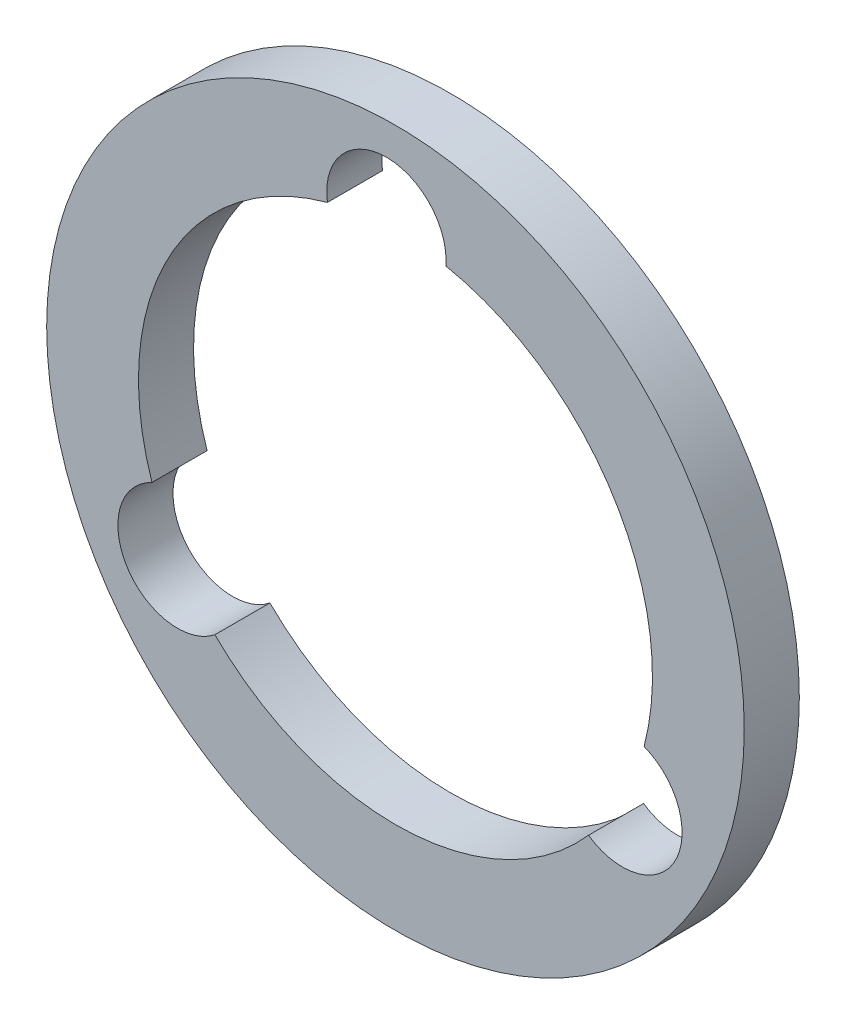
ISO-10303-21;
HEADER;
FILE_DESCRIPTION(('STEP AP214'),'2;1');
FILE_NAME('part.step','',(''),(''),'','','');
FILE_SCHEMA(('AUTOMOTIVE_DESIGN { 1 0 10303 214 1 1 1 1 }'));
ENDSEC;
DATA;
#1=APPLICATION_CONTEXT('core data for automotive mechanical design processes');
#2=APPLICATION_PROTOCOL_DEFINITION('international standard','automotive_design',2000,#1);
#3=PRODUCT_CONTEXT('',#1,'mechanical');
#4=PRODUCT('Part','Part','',(#3));
#5=PRODUCT_RELATED_PRODUCT_CATEGORY('part','',(#4));
#6=PRODUCT_DEFINITION_FORMATION('','',#4);
#7=PRODUCT_DEFINITION_CONTEXT('part definition',#1,'design');
#8=PRODUCT_DEFINITION('design','',#6,#7);
#9=PRODUCT_DEFINITION_SHAPE('','',#8);
#10=(LENGTH_UNIT() NAMED_UNIT(*) SI_UNIT(.MILLI.,.METRE.));
#11=(NAMED_UNIT(*) PLANE_ANGLE_UNIT() SI_UNIT($,.RADIAN.));
#12=(NAMED_UNIT(*) SI_UNIT($,.STERADIAN.) SOLID_ANGLE_UNIT());
#13=UNCERTAINTY_MEASURE_WITH_UNIT(LENGTH_MEASURE(1.E-05),#10,'distance_accuracy_value','');
#14=(GEOMETRIC_REPRESENTATION_CONTEXT(3) GLOBAL_UNCERTAINTY_ASSIGNED_CONTEXT((#13)) GLOBAL_UNIT_ASSIGNED_CONTEXT((#10,
#11,#12)) REPRESENTATION_CONTEXT('',''));
#15=CARTESIAN_POINT('',(0.,0.,0.));
#16=DIRECTION('',(0.,0.,1.));
#17=DIRECTION('',(1.,0.,0.));
#18=AXIS2_PLACEMENT_3D('',#15,#16,#17);
#19=CARTESIAN_POINT('',(0.,0.,3.));
#20=DIRECTION('',(0.,0.,1.));
#21=DIRECTION('',(1.,0.,0.));
#22=AXIS2_PLACEMENT_3D('',#19,#20,#21);
#23=PLANE('',#22);
#24=CARTESIAN_POINT('',(0.,0.,3.));
#25=DIRECTION('',(0.,0.,1.));
#26=DIRECTION('',(1.,0.,0.));
#27=AXIS2_PLACEMENT_3D('',#24,#25,#26);
#28=CIRCLE('',#27,19.);
#29=CARTESIAN_POINT('',(19.,0.,3.));
#30=VERTEX_POINT('',#29);
#31=EDGE_CURVE('E11',#30,#30,#28,.T.);
#32=ORIENTED_EDGE('',*,*,#31,.T.);
#33=EDGE_LOOP('',(#32));
#34=FACE_BOUND('',#33,.T.);
#35=CARTESIAN_POINT('',(-0.493805045382954,13.9912885960213,3.));
#36=DIRECTION('',(0.,0.,1.));
#37=DIRECTION('',(1.,0.,0.));
#38=AXIS2_PLACEMENT_3D('',#35,#36,#37);
#39=CIRCLE('',#38,3.25);
#40=CARTESIAN_POINT('',(2.745524809487,13.7281496757754,3.));
#41=VERTEX_POINT('',#40);
#42=CARTESIAN_POINT('',(-3.70652359519242,13.50043269078,3.));
#43=VERTEX_POINT('',#42);
#44=EDGE_CURVE('E94',#41,#43,#39,.T.);
#45=ORIENTED_EDGE('',*,*,#44,.F.);
#46=CARTESIAN_POINT('',(0.,0.,3.));
#47=DIRECTION('',(0.,0.,1.));
#48=DIRECTION('',(1.,0.,0.));
#49=AXIS2_PLACEMENT_3D('',#46,#47,#48);
#50=CIRCLE('',#49,14.);
#51=CARTESIAN_POINT('',(13.5449794698936,-3.54027275222695,3.));
#52=VERTEX_POINT('',#51);
#53=EDGE_CURVE('E86',#52,#41,#50,.T.);
#54=ORIENTED_EDGE('',*,*,#53,.F.);
#55=CARTESIAN_POINT('',(12.3637138785254,-6.56799658419206,3.));
#56=DIRECTION('',(0.,0.,1.));
#57=DIRECTION('',(1.,0.,0.));
#58=AXIS2_PLACEMENT_3D('',#55,#56,#57);
#59=CIRCLE('',#58,3.25);
#60=CARTESIAN_POINT('',(10.5161639614331,-9.24176906962385,3.));
#61=VERTEX_POINT('',#60);
#62=EDGE_CURVE('E114',#61,#52,#59,.T.);
#63=ORIENTED_EDGE('',*,*,#62,.F.);
#64=CARTESIAN_POINT('',(0.,0.,3.));
#65=DIRECTION('',(0.,0.,1.));
#66=DIRECTION('',(1.,0.,0.));
#67=AXIS2_PLACEMENT_3D('',#64,#65,#66);
#68=CIRCLE('',#67,14.);
#69=CARTESIAN_POINT('',(-9.83845587470119,-9.96015993855307,3.));
#70=VERTEX_POINT('',#69);
#71=EDGE_CURVE('E112',#70,#61,#68,.T.);
#72=ORIENTED_EDGE('',*,*,#71,.F.);
#73=CARTESIAN_POINT('',(-11.8699088331424,-7.4232920118292,3.));
#74=DIRECTION('',(0.,0.,1.));
#75=DIRECTION('',(1.,0.,0.));
#76=AXIS2_PLACEMENT_3D('',#73,#74,#75);
#77=CIRCLE('',#76,3.25);
#78=CARTESIAN_POINT('',(-13.2616887709201,-4.48638060615151,3.));
#79=VERTEX_POINT('',#78);
#80=EDGE_CURVE('E108',#79,#70,#77,.T.);
#81=ORIENTED_EDGE('',*,*,#80,.F.);
#82=CARTESIAN_POINT('',(0.,0.,3.));
#83=DIRECTION('',(0.,0.,1.));
#84=DIRECTION('',(1.,0.,0.));
#85=AXIS2_PLACEMENT_3D('',#82,#83,#84);
#86=CIRCLE('',#85,14.);
#87=EDGE_CURVE('E106',#43,#79,#86,.T.);
#88=ORIENTED_EDGE('',*,*,#87,.F.);
#89=EDGE_LOOP('',(#45,#54,#63,#72,#81,#88));
#90=FACE_BOUND('',#89,.T.);
#91=ADVANCED_FACE('F33',(#34,#90),#23,.T.);
#92=CARTESIAN_POINT('',(0.,0.,0.));
#93=DIRECTION('',(0.,0.,1.));
#94=DIRECTION('',(1.,0.,0.));
#95=AXIS2_PLACEMENT_3D('',#92,#93,#94);
#96=PLANE('',#95);
#97=CARTESIAN_POINT('',(0.,0.,0.));
#98=DIRECTION('',(0.,0.,1.));
#99=DIRECTION('',(1.,0.,0.));
#100=AXIS2_PLACEMENT_3D('',#97,#98,#99);
#101=CIRCLE('',#100,19.);
#102=CARTESIAN_POINT('',(19.,0.,0.));
#103=VERTEX_POINT('',#102);
#104=EDGE_CURVE('E37',#103,#103,#101,.T.);
#105=ORIENTED_EDGE('',*,*,#104,.F.);
#106=EDGE_LOOP('',(#105));
#107=FACE_BOUND('',#106,.T.);
#108=CARTESIAN_POINT('',(0.,0.,0.));
#109=DIRECTION('',(0.,0.,1.));
#110=DIRECTION('',(1.,0.,0.));
#111=AXIS2_PLACEMENT_3D('',#108,#109,#110);
#112=CIRCLE('',#111,14.);
#113=CARTESIAN_POINT('',(13.5449794698936,-3.54027275222694,0.));
#114=VERTEX_POINT('',#113);
#115=CARTESIAN_POINT('',(2.745524809487,13.7281496757754,0.));
#116=VERTEX_POINT('',#115);
#117=EDGE_CURVE('E56',#114,#116,#112,.T.);
#118=ORIENTED_EDGE('',*,*,#117,.T.);
#119=CARTESIAN_POINT('',(-0.493805045382954,13.9912885960213,0.));
#120=DIRECTION('',(0.,0.,1.));
#121=DIRECTION('',(1.,0.,0.));
#122=AXIS2_PLACEMENT_3D('',#119,#120,#121);
#123=CIRCLE('',#122,3.25);
#124=CARTESIAN_POINT('',(-3.70652359519242,13.50043269078,0.));
#125=VERTEX_POINT('',#124);
#126=EDGE_CURVE('E101',#116,#125,#123,.T.);
#127=ORIENTED_EDGE('',*,*,#126,.T.);
#128=CARTESIAN_POINT('',(0.,0.,0.));
#129=DIRECTION('',(0.,0.,1.));
#130=DIRECTION('',(1.,0.,0.));
#131=AXIS2_PLACEMENT_3D('',#128,#129,#130);
#132=CIRCLE('',#131,14.);
#133=CARTESIAN_POINT('',(-13.2616887709201,-4.48638060615151,0.));
#134=VERTEX_POINT('',#133);
#135=EDGE_CURVE('E118',#125,#134,#132,.T.);
#136=ORIENTED_EDGE('',*,*,#135,.T.);
#137=CARTESIAN_POINT('',(-11.8699088331424,-7.4232920118292,0.));
#138=DIRECTION('',(0.,0.,1.));
#139=DIRECTION('',(1.,0.,0.));
#140=AXIS2_PLACEMENT_3D('',#137,#138,#139);
#141=CIRCLE('',#140,3.25);
#142=CARTESIAN_POINT('',(-9.83845587470119,-9.96015993855307,0.));
#143=VERTEX_POINT('',#142);
#144=EDGE_CURVE('E121',#134,#143,#141,.T.);
#145=ORIENTED_EDGE('',*,*,#144,.T.);
#146=CARTESIAN_POINT('',(0.,0.,0.));
#147=DIRECTION('',(0.,0.,1.));
#148=DIRECTION('',(1.,0.,0.));
#149=AXIS2_PLACEMENT_3D('',#146,#147,#148);
#150=CIRCLE('',#149,14.);
#151=CARTESIAN_POINT('',(10.5161639614331,-9.24176906962386,0.));
#152=VERTEX_POINT('',#151);
#153=EDGE_CURVE('E124',#143,#152,#150,.T.);
#154=ORIENTED_EDGE('',*,*,#153,.T.);
#155=CARTESIAN_POINT('',(12.3637138785254,-6.56799658419206,0.));
#156=DIRECTION('',(0.,0.,1.));
#157=DIRECTION('',(1.,0.,0.));
#158=AXIS2_PLACEMENT_3D('',#155,#156,#157);
#159=CIRCLE('',#158,3.25);
#160=EDGE_CURVE('E95',#152,#114,#159,.T.);
#161=ORIENTED_EDGE('',*,*,#160,.T.);
#162=EDGE_LOOP('',(#118,#127,#136,#145,#154,#161));
#163=FACE_BOUND('',#162,.T.);
#164=ADVANCED_FACE('F141',(#107,#163),#96,.F.);
#165=CARTESIAN_POINT('',(0.,0.,3.));
#166=DIRECTION('',(0.,0.,-1.));
#167=DIRECTION('',(-1.,0.,0.));
#168=AXIS2_PLACEMENT_3D('',#165,#166,#167);
#169=CYLINDRICAL_SURFACE('',#168,19.);
#170=ORIENTED_EDGE('',*,*,#31,.F.);
#171=EDGE_LOOP('',(#170));
#172=FACE_BOUND('',#171,.T.);
#173=ORIENTED_EDGE('',*,*,#104,.T.);
#174=EDGE_LOOP('',(#173));
#175=FACE_BOUND('',#174,.T.);
#176=ADVANCED_FACE('F35',(#172,#175),#169,.T.);
#177=CARTESIAN_POINT('',(0.,0.,3.));
#178=DIRECTION('',(0.,0.,-1.));
#179=DIRECTION('',(-1.,0.,0.));
#180=AXIS2_PLACEMENT_3D('',#177,#178,#179);
#181=CYLINDRICAL_SURFACE('',#180,14.);
#182=ORIENTED_EDGE('',*,*,#117,.F.);
#183=DIRECTION('',(0.,0.,-1.));
#184=VECTOR('',#183,1.);
#185=CARTESIAN_POINT('',(13.5449794698936,-3.54027275222695,3.));
#186=LINE('',#185,#184);
#187=EDGE_CURVE('E90',#52,#114,#186,.T.);
#188=ORIENTED_EDGE('',*,*,#187,.F.);
#189=ORIENTED_EDGE('',*,*,#53,.T.);
#190=DIRECTION('',(0.,0.,-1.));
#191=VECTOR('',#190,1.);
#192=CARTESIAN_POINT('',(2.745524809487,13.7281496757754,3.));
#193=LINE('',#192,#191);
#194=EDGE_CURVE('E89',#41,#116,#193,.T.);
#195=ORIENTED_EDGE('',*,*,#194,.T.);
#196=EDGE_LOOP('',(#182,#188,#189,#195));
#197=FACE_BOUND('',#196,.T.);
#198=ADVANCED_FACE('F88',(#197),#181,.F.);
#199=CARTESIAN_POINT('',(-0.493805045382954,13.9912885960213,3.));
#200=DIRECTION('',(0.,0.,-1.));
#201=DIRECTION('',(-1.,0.,0.));
#202=AXIS2_PLACEMENT_3D('',#199,#200,#201);
#203=CYLINDRICAL_SURFACE('',#202,3.25);
#204=ORIENTED_EDGE('',*,*,#126,.F.);
#205=ORIENTED_EDGE('',*,*,#194,.F.);
#206=ORIENTED_EDGE('',*,*,#44,.T.);
#207=DIRECTION('',(0.,0.,-1.));
#208=VECTOR('',#207,1.);
#209=CARTESIAN_POINT('',(-3.70652359519242,13.50043269078,3.));
#210=LINE('',#209,#208);
#211=EDGE_CURVE('E102',#43,#125,#210,.T.);
#212=ORIENTED_EDGE('',*,*,#211,.T.);
#213=EDGE_LOOP('',(#204,#205,#206,#212));
#214=FACE_BOUND('',#213,.T.);
#215=ADVANCED_FACE('F98',(#214),#203,.F.);
#216=CARTESIAN_POINT('',(0.,0.,3.));
#217=DIRECTION('',(0.,0.,-1.));
#218=DIRECTION('',(-1.,0.,0.));
#219=AXIS2_PLACEMENT_3D('',#216,#217,#218);
#220=CYLINDRICAL_SURFACE('',#219,14.);
#221=ORIENTED_EDGE('',*,*,#135,.F.);
#222=ORIENTED_EDGE('',*,*,#211,.F.);
#223=ORIENTED_EDGE('',*,*,#87,.T.);
#224=DIRECTION('',(0.,0.,-1.));
#225=VECTOR('',#224,1.);
#226=CARTESIAN_POINT('',(-13.2616887709201,-4.48638060615151,3.));
#227=LINE('',#226,#225);
#228=EDGE_CURVE('E133',#79,#134,#227,.T.);
#229=ORIENTED_EDGE('',*,*,#228,.T.);
#230=EDGE_LOOP('',(#221,#222,#223,#229));
#231=FACE_BOUND('',#230,.T.);
#232=ADVANCED_FACE('F137',(#231),#220,.F.);
#233=CARTESIAN_POINT('',(-11.8699088331424,-7.4232920118292,3.));
#234=DIRECTION('',(0.,0.,-1.));
#235=DIRECTION('',(-1.,0.,0.));
#236=AXIS2_PLACEMENT_3D('',#233,#234,#235);
#237=CYLINDRICAL_SURFACE('',#236,3.25);
#238=ORIENTED_EDGE('',*,*,#144,.F.);
#239=ORIENTED_EDGE('',*,*,#228,.F.);
#240=ORIENTED_EDGE('',*,*,#80,.T.);
#241=DIRECTION('',(0.,0.,-1.));
#242=VECTOR('',#241,1.);
#243=CARTESIAN_POINT('',(-9.83845587470119,-9.96015993855307,3.));
#244=LINE('',#243,#242);
#245=EDGE_CURVE('E131',#70,#143,#244,.T.);
#246=ORIENTED_EDGE('',*,*,#245,.T.);
#247=EDGE_LOOP('',(#238,#239,#240,#246));
#248=FACE_BOUND('',#247,.T.);
#249=ADVANCED_FACE('F149',(#248),#237,.F.);
#250=CARTESIAN_POINT('',(0.,0.,3.));
#251=DIRECTION('',(0.,0.,-1.));
#252=DIRECTION('',(-1.,0.,0.));
#253=AXIS2_PLACEMENT_3D('',#250,#251,#252);
#254=CYLINDRICAL_SURFACE('',#253,14.);
#255=ORIENTED_EDGE('',*,*,#153,.F.);
#256=ORIENTED_EDGE('',*,*,#245,.F.);
#257=ORIENTED_EDGE('',*,*,#71,.T.);
#258=DIRECTION('',(0.,0.,-1.));
#259=VECTOR('',#258,1.);
#260=CARTESIAN_POINT('',(10.5161639614331,-9.24176906962386,3.));
#261=LINE('',#260,#259);
#262=EDGE_CURVE('E48',#61,#152,#261,.T.);
#263=ORIENTED_EDGE('',*,*,#262,.T.);
#264=EDGE_LOOP('',(#255,#256,#257,#263));
#265=FACE_BOUND('',#264,.T.);
#266=ADVANCED_FACE('F147',(#265),#254,.F.);
#267=CARTESIAN_POINT('',(12.3637138785254,-6.56799658419206,3.));
#268=DIRECTION('',(0.,0.,-1.));
#269=DIRECTION('',(-1.,0.,0.));
#270=AXIS2_PLACEMENT_3D('',#267,#268,#269);
#271=CYLINDRICAL_SURFACE('',#270,3.25);
#272=ORIENTED_EDGE('',*,*,#160,.F.);
#273=ORIENTED_EDGE('',*,*,#262,.F.);
#274=ORIENTED_EDGE('',*,*,#62,.T.);
#275=ORIENTED_EDGE('',*,*,#187,.T.);
#276=EDGE_LOOP('',(#272,#273,#274,#275));
#277=FACE_BOUND('',#276,.T.);
#278=ADVANCED_FACE('F143',(#277),#271,.F.);
#279=CLOSED_SHELL('',(#91,#164,#176,#198,#215,#232,#249,#266,#278));
#280=MANIFOLD_SOLID_BREP('B2',#279);
#281=ADVANCED_BREP_SHAPE_REPRESENTATION('',(#18,#280),#14);
#282=SHAPE_DEFINITION_REPRESENTATION(#9,#281);
ENDSEC;
END-ISO-10303-21;
